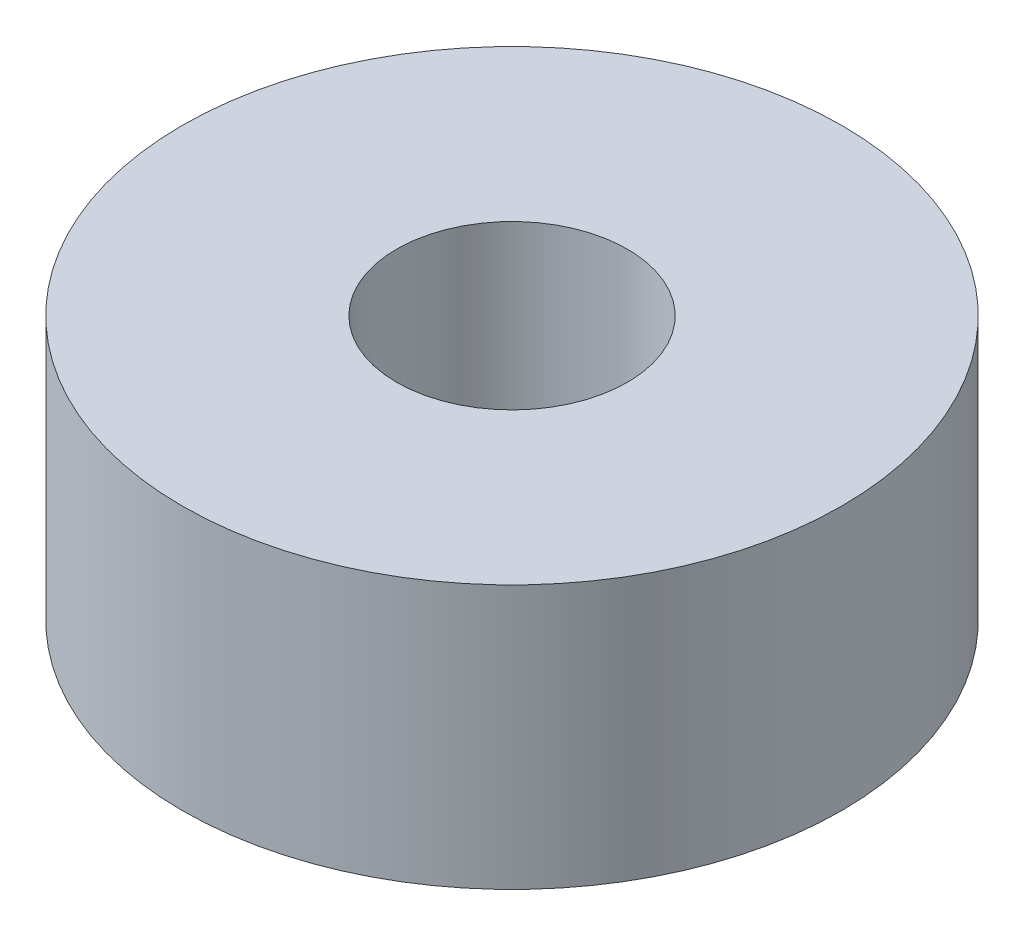
ISO-10303-21;
HEADER;
FILE_DESCRIPTION(('STEP AP214'),'2;1');
FILE_NAME('part.step','',(''),(''),'','','');
FILE_SCHEMA(('AUTOMOTIVE_DESIGN { 1 0 10303 214 1 1 1 1 }'));
ENDSEC;
DATA;
#1=APPLICATION_CONTEXT('core data for automotive mechanical design processes');
#2=APPLICATION_PROTOCOL_DEFINITION('international standard','automotive_design',2000,#1);
#3=PRODUCT_CONTEXT('',#1,'mechanical');
#4=PRODUCT('Part','Part','',(#3));
#5=PRODUCT_RELATED_PRODUCT_CATEGORY('part','',(#4));
#6=PRODUCT_DEFINITION_FORMATION('','',#4);
#7=PRODUCT_DEFINITION_CONTEXT('part definition',#1,'design');
#8=PRODUCT_DEFINITION('design','',#6,#7);
#9=PRODUCT_DEFINITION_SHAPE('','',#8);
#10=(LENGTH_UNIT() NAMED_UNIT(*) SI_UNIT(.MILLI.,.METRE.));
#11=(NAMED_UNIT(*) PLANE_ANGLE_UNIT() SI_UNIT($,.RADIAN.));
#12=(NAMED_UNIT(*) SI_UNIT($,.STERADIAN.) SOLID_ANGLE_UNIT());
#13=UNCERTAINTY_MEASURE_WITH_UNIT(LENGTH_MEASURE(1.E-05),#10,'distance_accuracy_value','');
#14=(GEOMETRIC_REPRESENTATION_CONTEXT(3) GLOBAL_UNCERTAINTY_ASSIGNED_CONTEXT((#13)) GLOBAL_UNIT_ASSIGNED_CONTEXT((#10,
#11,#12)) REPRESENTATION_CONTEXT('',''));
#15=CARTESIAN_POINT('',(0.,0.,0.));
#16=DIRECTION('',(0.,0.,1.));
#17=DIRECTION('',(1.,0.,0.));
#18=AXIS2_PLACEMENT_3D('',#15,#16,#17);
#19=CARTESIAN_POINT('',(0.,4.,0.));
#20=DIRECTION('',(0.,1.,0.));
#21=DIRECTION('',(0.,0.,1.));
#22=AXIS2_PLACEMENT_3D('',#19,#20,#21);
#23=PLANE('',#22);
#24=CARTESIAN_POINT('',(0.,4.,0.));
#25=DIRECTION('',(0.,1.,0.));
#26=DIRECTION('',(0.,0.,1.));
#27=AXIS2_PLACEMENT_3D('',#24,#25,#26);
#28=CIRCLE('',#27,5.);
#29=CARTESIAN_POINT('',(0.,4.,5.));
#30=VERTEX_POINT('',#29);
#31=EDGE_CURVE('E10',#30,#30,#28,.T.);
#32=ORIENTED_EDGE('',*,*,#31,.T.);
#33=EDGE_LOOP('',(#32));
#34=FACE_BOUND('',#33,.T.);
#35=CARTESIAN_POINT('',(0.,4.,0.));
#36=DIRECTION('',(0.,1.,0.));
#37=DIRECTION('',(0.,0.,1.));
#38=AXIS2_PLACEMENT_3D('',#35,#36,#37);
#39=CIRCLE('',#38,1.75);
#40=CARTESIAN_POINT('',(0.,4.,1.75));
#41=VERTEX_POINT('',#40);
#42=EDGE_CURVE('E50',#41,#41,#39,.T.);
#43=ORIENTED_EDGE('',*,*,#42,.F.);
#44=EDGE_LOOP('',(#43));
#45=FACE_BOUND('',#44,.T.);
#46=ADVANCED_FACE('F37',(#34,#45),#23,.T.);
#47=CARTESIAN_POINT('',(0.,0.,0.));
#48=DIRECTION('',(0.,1.,0.));
#49=DIRECTION('',(0.,0.,1.));
#50=AXIS2_PLACEMENT_3D('',#47,#48,#49);
#51=PLANE('',#50);
#52=CARTESIAN_POINT('',(0.,0.,0.));
#53=DIRECTION('',(0.,1.,0.));
#54=DIRECTION('',(0.,0.,1.));
#55=AXIS2_PLACEMENT_3D('',#52,#53,#54);
#56=CIRCLE('',#55,5.);
#57=CARTESIAN_POINT('',(0.,0.,5.));
#58=VERTEX_POINT('',#57);
#59=EDGE_CURVE('E41',#58,#58,#56,.T.);
#60=ORIENTED_EDGE('',*,*,#59,.F.);
#61=EDGE_LOOP('',(#60));
#62=FACE_BOUND('',#61,.T.);
#63=CARTESIAN_POINT('',(0.,0.,0.));
#64=DIRECTION('',(0.,1.,0.));
#65=DIRECTION('',(0.,0.,1.));
#66=AXIS2_PLACEMENT_3D('',#63,#64,#65);
#67=CIRCLE('',#66,1.75);
#68=CARTESIAN_POINT('',(0.,0.,1.75));
#69=VERTEX_POINT('',#68);
#70=EDGE_CURVE('E52',#69,#69,#67,.T.);
#71=ORIENTED_EDGE('',*,*,#70,.T.);
#72=EDGE_LOOP('',(#71));
#73=FACE_BOUND('',#72,.T.);
#74=ADVANCED_FACE('F64',(#62,#73),#51,.F.);
#75=CARTESIAN_POINT('',(0.,4.,0.));
#76=DIRECTION('',(0.,-1.,0.));
#77=DIRECTION('',(0.,0.,-1.));
#78=AXIS2_PLACEMENT_3D('',#75,#76,#77);
#79=CYLINDRICAL_SURFACE('',#78,5.);
#80=ORIENTED_EDGE('',*,*,#31,.F.);
#81=EDGE_LOOP('',(#80));
#82=FACE_BOUND('',#81,.T.);
#83=ORIENTED_EDGE('',*,*,#59,.T.);
#84=EDGE_LOOP('',(#83));
#85=FACE_BOUND('',#84,.T.);
#86=ADVANCED_FACE('F39',(#82,#85),#79,.T.);
#87=CARTESIAN_POINT('',(0.,4.,0.));
#88=DIRECTION('',(0.,-1.,0.));
#89=DIRECTION('',(0.,0.,-1.));
#90=AXIS2_PLACEMENT_3D('',#87,#88,#89);
#91=CYLINDRICAL_SURFACE('',#90,1.75);
#92=ORIENTED_EDGE('',*,*,#42,.T.);
#93=EDGE_LOOP('',(#92));
#94=FACE_BOUND('',#93,.T.);
#95=ORIENTED_EDGE('',*,*,#70,.F.);
#96=EDGE_LOOP('',(#95));
#97=FACE_BOUND('',#96,.T.);
#98=ADVANCED_FACE('F60',(#94,#97),#91,.F.);
#99=CLOSED_SHELL('',(#46,#74,#86,#98));
#100=MANIFOLD_SOLID_BREP('B2',#99);
#101=ADVANCED_BREP_SHAPE_REPRESENTATION('',(#18,#100),#14);
#102=SHAPE_DEFINITION_REPRESENTATION(#9,#101);
ENDSEC;
END-ISO-10303-21;
